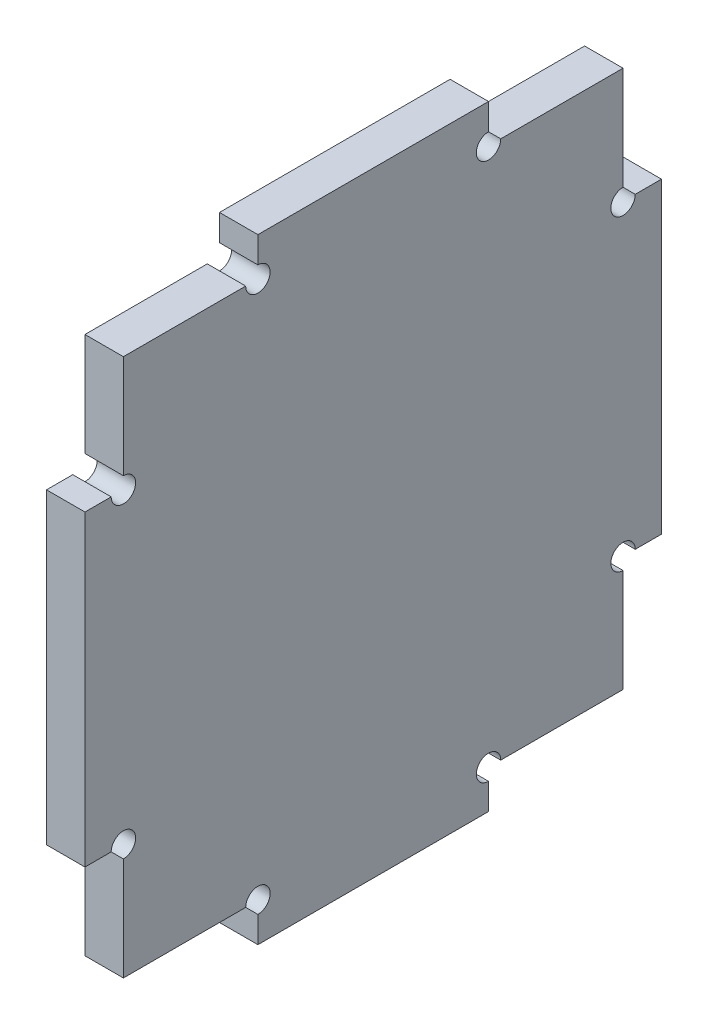
ISO-10303-21;
HEADER;
FILE_DESCRIPTION(('STEP AP214'),'2;1');
FILE_NAME('part.step','',(''),(''),'','','');
FILE_SCHEMA(('AUTOMOTIVE_DESIGN { 1 0 10303 214 1 1 1 1 }'));
ENDSEC;
DATA;
#1=APPLICATION_CONTEXT('core data for automotive mechanical design processes');
#2=APPLICATION_PROTOCOL_DEFINITION('international standard','automotive_design',2000,#1);
#3=PRODUCT_CONTEXT('',#1,'mechanical');
#4=PRODUCT('Part','Part','',(#3));
#5=PRODUCT_RELATED_PRODUCT_CATEGORY('part','',(#4));
#6=PRODUCT_DEFINITION_FORMATION('','',#4);
#7=PRODUCT_DEFINITION_CONTEXT('part definition',#1,'design');
#8=PRODUCT_DEFINITION('design','',#6,#7);
#9=PRODUCT_DEFINITION_SHAPE('','',#8);
#10=(LENGTH_UNIT() NAMED_UNIT(*) SI_UNIT(.MILLI.,.METRE.));
#11=(NAMED_UNIT(*) PLANE_ANGLE_UNIT() SI_UNIT($,.RADIAN.));
#12=(NAMED_UNIT(*) SI_UNIT($,.STERADIAN.) SOLID_ANGLE_UNIT());
#13=UNCERTAINTY_MEASURE_WITH_UNIT(LENGTH_MEASURE(1.E-05),#10,'distance_accuracy_value','');
#14=(GEOMETRIC_REPRESENTATION_CONTEXT(3) GLOBAL_UNCERTAINTY_ASSIGNED_CONTEXT((#13)) GLOBAL_UNIT_ASSIGNED_CONTEXT((#10,
#11,#12)) REPRESENTATION_CONTEXT('',''));
#15=CARTESIAN_POINT('',(0.,0.,0.));
#16=DIRECTION('',(0.,0.,1.));
#17=DIRECTION('',(1.,0.,0.));
#18=AXIS2_PLACEMENT_3D('',#15,#16,#17);
#19=CARTESIAN_POINT('',(5.,0.,0.));
#20=DIRECTION('',(-1.,0.,0.));
#21=DIRECTION('',(0.,0.,1.));
#22=AXIS2_PLACEMENT_3D('',#19,#20,#21);
#23=PLANE('',#22);
#24=DIRECTION('',(0.,-1.,0.));
#25=VECTOR('',#24,1.);
#26=CARTESIAN_POINT('',(5.,0.,32.5));
#27=LINE('',#26,#25);
#28=CARTESIAN_POINT('',(5.,35.,32.5));
#29=VERTEX_POINT('',#28);
#30=CARTESIAN_POINT('',(5.,21.5875,32.5));
#31=VERTEX_POINT('',#30);
#32=EDGE_CURVE('E366',#29,#31,#27,.T.);
#33=ORIENTED_EDGE('',*,*,#32,.T.);
#34=CARTESIAN_POINT('',(5.,20.,32.5));
#35=DIRECTION('',(1.,0.,0.));
#36=DIRECTION('',(0.,0.,-1.));
#37=AXIS2_PLACEMENT_3D('',#34,#35,#36);
#38=CIRCLE('',#37,1.5875);
#39=CARTESIAN_POINT('',(5.,20.,34.0875));
#40=VERTEX_POINT('',#39);
#41=EDGE_CURVE('E440',#40,#31,#38,.T.);
#42=ORIENTED_EDGE('',*,*,#41,.F.);
#43=DIRECTION('',(0.,0.,1.));
#44=VECTOR('',#43,1.);
#45=CARTESIAN_POINT('',(5.,20.,0.));
#46=LINE('',#45,#44);
#47=CARTESIAN_POINT('',(5.,20.,37.5));
#48=VERTEX_POINT('',#47);
#49=EDGE_CURVE('E356',#40,#48,#46,.T.);
#50=ORIENTED_EDGE('',*,*,#49,.T.);
#51=DIRECTION('',(0.,-1.,0.));
#52=VECTOR('',#51,1.);
#53=CARTESIAN_POINT('',(5.,-40.,37.5));
#54=LINE('',#53,#52);
#55=CARTESIAN_POINT('',(5.,-20.,37.5));
#56=VERTEX_POINT('',#55);
#57=EDGE_CURVE('E385',#48,#56,#54,.T.);
#58=ORIENTED_EDGE('',*,*,#57,.T.);
#59=DIRECTION('',(0.,0.,1.));
#60=VECTOR('',#59,1.);
#61=CARTESIAN_POINT('',(5.,-20.,0.));
#62=LINE('',#61,#60);
#63=CARTESIAN_POINT('',(5.,-20.,34.0875));
#64=VERTEX_POINT('',#63);
#65=EDGE_CURVE('E334',#64,#56,#62,.T.);
#66=ORIENTED_EDGE('',*,*,#65,.F.);
#67=CARTESIAN_POINT('',(5.,-20.,32.5));
#68=DIRECTION('',(1.,0.,0.));
#69=DIRECTION('',(0.,0.,-1.));
#70=AXIS2_PLACEMENT_3D('',#67,#68,#69);
#71=CIRCLE('',#70,1.5875);
#72=CARTESIAN_POINT('',(5.,-21.5875,32.5));
#73=VERTEX_POINT('',#72);
#74=EDGE_CURVE('E446',#73,#64,#71,.T.);
#75=ORIENTED_EDGE('',*,*,#74,.F.);
#76=DIRECTION('',(0.,1.,0.));
#77=VECTOR('',#76,1.);
#78=CARTESIAN_POINT('',(5.,0.,32.5));
#79=LINE('',#78,#77);
#80=CARTESIAN_POINT('',(5.,-35.,32.5));
#81=VERTEX_POINT('',#80);
#82=EDGE_CURVE('E330',#81,#73,#79,.T.);
#83=ORIENTED_EDGE('',*,*,#82,.F.);
#84=DIRECTION('',(0.,0.,1.));
#85=VECTOR('',#84,1.);
#86=CARTESIAN_POINT('',(5.,-35.,0.));
#87=LINE('',#86,#85);
#88=CARTESIAN_POINT('',(5.,-35.,16.5875));
#89=VERTEX_POINT('',#88);
#90=EDGE_CURVE('E327',#89,#81,#87,.T.);
#91=ORIENTED_EDGE('',*,*,#90,.F.);
#92=CARTESIAN_POINT('',(5.,-35.,15.));
#93=DIRECTION('',(1.,0.,0.));
#94=DIRECTION('',(0.,0.,-1.));
#95=AXIS2_PLACEMENT_3D('',#92,#93,#94);
#96=CIRCLE('',#95,1.5875);
#97=CARTESIAN_POINT('',(5.,-36.5875,15.));
#98=VERTEX_POINT('',#97);
#99=EDGE_CURVE('E545',#98,#89,#96,.T.);
#100=ORIENTED_EDGE('',*,*,#99,.F.);
#101=DIRECTION('',(0.,1.,0.));
#102=VECTOR('',#101,1.);
#103=CARTESIAN_POINT('',(5.,0.,15.));
#104=LINE('',#103,#102);
#105=CARTESIAN_POINT('',(5.,-40.,15.));
#106=VERTEX_POINT('',#105);
#107=EDGE_CURVE('E317',#106,#98,#104,.T.);
#108=ORIENTED_EDGE('',*,*,#107,.F.);
#109=DIRECTION('',(0.,0.,-1.));
#110=VECTOR('',#109,1.);
#111=CARTESIAN_POINT('',(5.,-40.,37.5));
#112=LINE('',#111,#110);
#113=CARTESIAN_POINT('',(5.,-40.,-15.));
#114=VERTEX_POINT('',#113);
#115=EDGE_CURVE('E389',#106,#114,#112,.T.);
#116=ORIENTED_EDGE('',*,*,#115,.T.);
#117=DIRECTION('',(0.,1.,0.));
#118=VECTOR('',#117,1.);
#119=CARTESIAN_POINT('',(5.,0.,-15.));
#120=LINE('',#119,#118);
#121=CARTESIAN_POINT('',(5.,-36.5875,-15.));
#122=VERTEX_POINT('',#121);
#123=EDGE_CURVE('E243',#114,#122,#120,.T.);
#124=ORIENTED_EDGE('',*,*,#123,.T.);
#125=CARTESIAN_POINT('',(5.,-35.,-15.));
#126=DIRECTION('',(1.,0.,0.));
#127=DIRECTION('',(0.,0.,-1.));
#128=AXIS2_PLACEMENT_3D('',#125,#126,#127);
#129=CIRCLE('',#128,1.5875);
#130=CARTESIAN_POINT('',(5.,-35.,-16.5875));
#131=VERTEX_POINT('',#130);
#132=EDGE_CURVE('E225',#131,#122,#129,.T.);
#133=ORIENTED_EDGE('',*,*,#132,.F.);
#134=DIRECTION('',(0.,0.,-1.));
#135=VECTOR('',#134,1.);
#136=CARTESIAN_POINT('',(5.,-35.,0.));
#137=LINE('',#136,#135);
#138=CARTESIAN_POINT('',(5.,-35.,-32.5));
#139=VERTEX_POINT('',#138);
#140=EDGE_CURVE('E240',#131,#139,#137,.T.);
#141=ORIENTED_EDGE('',*,*,#140,.T.);
#142=DIRECTION('',(0.,1.,0.));
#143=VECTOR('',#142,1.);
#144=CARTESIAN_POINT('',(5.,0.,-32.5));
#145=LINE('',#144,#143);
#146=CARTESIAN_POINT('',(5.,-21.5875,-32.5));
#147=VERTEX_POINT('',#146);
#148=EDGE_CURVE('E253',#139,#147,#145,.T.);
#149=ORIENTED_EDGE('',*,*,#148,.T.);
#150=CARTESIAN_POINT('',(5.,-20.,-32.5));
#151=DIRECTION('',(1.,0.,0.));
#152=DIRECTION('',(0.,0.,-1.));
#153=AXIS2_PLACEMENT_3D('',#150,#151,#152);
#154=CIRCLE('',#153,1.5875);
#155=CARTESIAN_POINT('',(5.,-20.,-34.0875));
#156=VERTEX_POINT('',#155);
#157=EDGE_CURVE('E507',#156,#147,#154,.T.);
#158=ORIENTED_EDGE('',*,*,#157,.F.);
#159=DIRECTION('',(0.,0.,-1.));
#160=VECTOR('',#159,1.);
#161=CARTESIAN_POINT('',(5.,-20.,0.));
#162=LINE('',#161,#160);
#163=CARTESIAN_POINT('',(5.,-20.,-37.5));
#164=VERTEX_POINT('',#163);
#165=EDGE_CURVE('E259',#156,#164,#162,.T.);
#166=ORIENTED_EDGE('',*,*,#165,.T.);
#167=DIRECTION('',(0.,1.,0.));
#168=VECTOR('',#167,1.);
#169=CARTESIAN_POINT('',(5.,-40.,-37.5));
#170=LINE('',#169,#168);
#171=CARTESIAN_POINT('',(5.,20.,-37.5));
#172=VERTEX_POINT('',#171);
#173=EDGE_CURVE('E377',#164,#172,#170,.T.);
#174=ORIENTED_EDGE('',*,*,#173,.T.);
#175=DIRECTION('',(0.,0.,-1.));
#176=VECTOR('',#175,1.);
#177=CARTESIAN_POINT('',(5.,20.,0.));
#178=LINE('',#177,#176);
#179=CARTESIAN_POINT('',(5.,20.,-34.0875));
#180=VERTEX_POINT('',#179);
#181=EDGE_CURVE('E288',#180,#172,#178,.T.);
#182=ORIENTED_EDGE('',*,*,#181,.F.);
#183=CARTESIAN_POINT('',(5.,20.,-32.5));
#184=DIRECTION('',(1.,0.,0.));
#185=DIRECTION('',(0.,0.,-1.));
#186=AXIS2_PLACEMENT_3D('',#183,#184,#185);
#187=CIRCLE('',#186,1.5875);
#188=CARTESIAN_POINT('',(5.,21.5875,-32.5));
#189=VERTEX_POINT('',#188);
#190=EDGE_CURVE('E526',#189,#180,#187,.T.);
#191=ORIENTED_EDGE('',*,*,#190,.F.);
#192=DIRECTION('',(0.,-1.,0.));
#193=VECTOR('',#192,1.);
#194=CARTESIAN_POINT('',(5.,0.,-32.5));
#195=LINE('',#194,#193);
#196=CARTESIAN_POINT('',(5.,35.,-32.5));
#197=VERTEX_POINT('',#196);
#198=EDGE_CURVE('E294',#197,#189,#195,.T.);
#199=ORIENTED_EDGE('',*,*,#198,.F.);
#200=DIRECTION('',(0.,0.,-1.));
#201=VECTOR('',#200,1.);
#202=CARTESIAN_POINT('',(5.,35.,0.));
#203=LINE('',#202,#201);
#204=CARTESIAN_POINT('',(5.,35.,-16.5875));
#205=VERTEX_POINT('',#204);
#206=EDGE_CURVE('E291',#205,#197,#203,.T.);
#207=ORIENTED_EDGE('',*,*,#206,.F.);
#208=CARTESIAN_POINT('',(5.,35.,-15.));
#209=DIRECTION('',(1.,0.,0.));
#210=DIRECTION('',(0.,0.,-1.));
#211=AXIS2_PLACEMENT_3D('',#208,#209,#210);
#212=CIRCLE('',#211,1.5875);
#213=CARTESIAN_POINT('',(5.,36.5875,-15.));
#214=VERTEX_POINT('',#213);
#215=EDGE_CURVE('E525',#214,#205,#212,.T.);
#216=ORIENTED_EDGE('',*,*,#215,.F.);
#217=DIRECTION('',(0.,-1.,0.));
#218=VECTOR('',#217,1.);
#219=CARTESIAN_POINT('',(5.,0.,-15.));
#220=LINE('',#219,#218);
#221=CARTESIAN_POINT('',(5.,40.,-15.));
#222=VERTEX_POINT('',#221);
#223=EDGE_CURVE('E278',#222,#214,#220,.T.);
#224=ORIENTED_EDGE('',*,*,#223,.F.);
#225=DIRECTION('',(0.,0.,1.));
#226=VECTOR('',#225,1.);
#227=CARTESIAN_POINT('',(5.,40.,37.5));
#228=LINE('',#227,#226);
#229=CARTESIAN_POINT('',(5.,40.,15.));
#230=VERTEX_POINT('',#229);
#231=EDGE_CURVE('E381',#222,#230,#228,.T.);
#232=ORIENTED_EDGE('',*,*,#231,.T.);
#233=DIRECTION('',(0.,-1.,0.));
#234=VECTOR('',#233,1.);
#235=CARTESIAN_POINT('',(5.,0.,15.));
#236=LINE('',#235,#234);
#237=CARTESIAN_POINT('',(5.,36.5875,15.));
#238=VERTEX_POINT('',#237);
#239=EDGE_CURVE('E372',#230,#238,#236,.T.);
#240=ORIENTED_EDGE('',*,*,#239,.T.);
#241=CARTESIAN_POINT('',(5.,35.,15.));
#242=DIRECTION('',(1.,0.,0.));
#243=DIRECTION('',(0.,0.,-1.));
#244=AXIS2_PLACEMENT_3D('',#241,#242,#243);
#245=CIRCLE('',#244,1.5875);
#246=CARTESIAN_POINT('',(5.,35.,16.5875));
#247=VERTEX_POINT('',#246);
#248=EDGE_CURVE('E452',#247,#238,#245,.T.);
#249=ORIENTED_EDGE('',*,*,#248,.F.);
#250=DIRECTION('',(0.,0.,1.));
#251=VECTOR('',#250,1.);
#252=CARTESIAN_POINT('',(5.,35.,0.));
#253=LINE('',#252,#251);
#254=EDGE_CURVE('E369',#247,#29,#253,.T.);
#255=ORIENTED_EDGE('',*,*,#254,.T.);
#256=EDGE_LOOP('',(#33,#42,#50,#58,#66,#75,#83,#91,#100,#108,#116,#124,#133,#141,#149,#158,#166,
#174,#182,#191,#199,#207,#216,#224,#232,#240,#249,#255));
#257=FACE_BOUND('',#256,.T.);
#258=ADVANCED_FACE('F38',(#257),#23,.F.);
#259=CARTESIAN_POINT('',(0.,0.,0.));
#260=DIRECTION('',(-1.,0.,0.));
#261=DIRECTION('',(0.,0.,1.));
#262=AXIS2_PLACEMENT_3D('',#259,#260,#261);
#263=PLANE('',#262);
#264=CARTESIAN_POINT('',(0.,20.,32.5));
#265=DIRECTION('',(1.,0.,0.));
#266=DIRECTION('',(0.,0.,-1.));
#267=AXIS2_PLACEMENT_3D('',#264,#265,#266);
#268=CIRCLE('',#267,1.5875);
#269=CARTESIAN_POINT('',(0.,20.,34.0875));
#270=VERTEX_POINT('',#269);
#271=CARTESIAN_POINT('',(0.,21.5875,32.5));
#272=VERTEX_POINT('',#271);
#273=EDGE_CURVE('E61',#270,#272,#268,.T.);
#274=ORIENTED_EDGE('',*,*,#273,.T.);
#275=DIRECTION('',(0.,1.,0.));
#276=VECTOR('',#275,1.);
#277=CARTESIAN_POINT('',(0.,20.,32.5));
#278=LINE('',#277,#276);
#279=CARTESIAN_POINT('',(0.,35.,32.5));
#280=VERTEX_POINT('',#279);
#281=EDGE_CURVE('E341',#272,#280,#278,.T.);
#282=ORIENTED_EDGE('',*,*,#281,.T.);
#283=DIRECTION('',(0.,0.,-1.));
#284=VECTOR('',#283,1.);
#285=CARTESIAN_POINT('',(0.,35.,32.5));
#286=LINE('',#285,#284);
#287=CARTESIAN_POINT('',(0.,35.,16.5875));
#288=VERTEX_POINT('',#287);
#289=EDGE_CURVE('E344',#280,#288,#286,.T.);
#290=ORIENTED_EDGE('',*,*,#289,.T.);
#291=CARTESIAN_POINT('',(0.,35.,15.));
#292=DIRECTION('',(1.,0.,0.));
#293=DIRECTION('',(0.,0.,-1.));
#294=AXIS2_PLACEMENT_3D('',#291,#292,#293);
#295=CIRCLE('',#294,1.5875);
#296=CARTESIAN_POINT('',(0.,36.5875,15.));
#297=VERTEX_POINT('',#296);
#298=EDGE_CURVE('E54',#288,#297,#295,.T.);
#299=ORIENTED_EDGE('',*,*,#298,.T.);
#300=DIRECTION('',(0.,1.,0.));
#301=VECTOR('',#300,1.);
#302=CARTESIAN_POINT('',(0.,35.,15.));
#303=LINE('',#302,#301);
#304=CARTESIAN_POINT('',(0.,40.,15.));
#305=VERTEX_POINT('',#304);
#306=EDGE_CURVE('E348',#297,#305,#303,.T.);
#307=ORIENTED_EDGE('',*,*,#306,.T.);
#308=DIRECTION('',(0.,0.,1.));
#309=VECTOR('',#308,1.);
#310=CARTESIAN_POINT('',(0.,40.,37.5));
#311=LINE('',#310,#309);
#312=CARTESIAN_POINT('',(0.,40.,-15.));
#313=VERTEX_POINT('',#312);
#314=EDGE_CURVE('E395',#313,#305,#311,.T.);
#315=ORIENTED_EDGE('',*,*,#314,.F.);
#316=DIRECTION('',(0.,1.,0.));
#317=VECTOR('',#316,1.);
#318=CARTESIAN_POINT('',(0.,35.,-15.));
#319=LINE('',#318,#317);
#320=CARTESIAN_POINT('',(0.,36.5875,-15.));
#321=VERTEX_POINT('',#320);
#322=EDGE_CURVE('E252',#321,#313,#319,.T.);
#323=ORIENTED_EDGE('',*,*,#322,.F.);
#324=CARTESIAN_POINT('',(0.,35.,-15.));
#325=DIRECTION('',(1.,0.,0.));
#326=DIRECTION('',(0.,0.,-1.));
#327=AXIS2_PLACEMENT_3D('',#324,#325,#326);
#328=CIRCLE('',#327,1.5875);
#329=CARTESIAN_POINT('',(0.,35.,-16.5875));
#330=VERTEX_POINT('',#329);
#331=EDGE_CURVE('E454',#321,#330,#328,.T.);
#332=ORIENTED_EDGE('',*,*,#331,.T.);
#333=DIRECTION('',(0.,0.,1.));
#334=VECTOR('',#333,1.);
#335=CARTESIAN_POINT('',(0.,35.,-32.5));
#336=LINE('',#335,#334);
#337=CARTESIAN_POINT('',(0.,35.,-32.5));
#338=VERTEX_POINT('',#337);
#339=EDGE_CURVE('E257',#338,#330,#336,.T.);
#340=ORIENTED_EDGE('',*,*,#339,.F.);
#341=DIRECTION('',(0.,1.,0.));
#342=VECTOR('',#341,1.);
#343=CARTESIAN_POINT('',(0.,20.,-32.5));
#344=LINE('',#343,#342);
#345=CARTESIAN_POINT('',(0.,21.5875,-32.5));
#346=VERTEX_POINT('',#345);
#347=EDGE_CURVE('E266',#346,#338,#344,.T.);
#348=ORIENTED_EDGE('',*,*,#347,.F.);
#349=CARTESIAN_POINT('',(0.,20.,-32.5));
#350=DIRECTION('',(1.,0.,0.));
#351=DIRECTION('',(0.,0.,-1.));
#352=AXIS2_PLACEMENT_3D('',#349,#350,#351);
#353=CIRCLE('',#352,1.5875);
#354=CARTESIAN_POINT('',(0.,20.,-34.0875));
#355=VERTEX_POINT('',#354);
#356=EDGE_CURVE('E520',#346,#355,#353,.T.);
#357=ORIENTED_EDGE('',*,*,#356,.T.);
#358=DIRECTION('',(0.,0.,1.));
#359=VECTOR('',#358,1.);
#360=CARTESIAN_POINT('',(0.,20.,-37.5));
#361=LINE('',#360,#359);
#362=CARTESIAN_POINT('',(0.,20.,-37.5));
#363=VERTEX_POINT('',#362);
#364=EDGE_CURVE('E269',#363,#355,#361,.T.);
#365=ORIENTED_EDGE('',*,*,#364,.F.);
#366=DIRECTION('',(0.,1.,0.));
#367=VECTOR('',#366,1.);
#368=CARTESIAN_POINT('',(0.,-40.,-37.5));
#369=LINE('',#368,#367);
#370=CARTESIAN_POINT('',(0.,-20.,-37.5));
#371=VERTEX_POINT('',#370);
#372=EDGE_CURVE('E376',#371,#363,#369,.T.);
#373=ORIENTED_EDGE('',*,*,#372,.F.);
#374=DIRECTION('',(0.,0.,1.));
#375=VECTOR('',#374,1.);
#376=CARTESIAN_POINT('',(0.,-20.,-37.5));
#377=LINE('',#376,#375);
#378=CARTESIAN_POINT('',(0.,-20.,-34.0875));
#379=VERTEX_POINT('',#378);
#380=EDGE_CURVE('E478',#371,#379,#377,.T.);
#381=ORIENTED_EDGE('',*,*,#380,.T.);
#382=CARTESIAN_POINT('',(0.,-20.,-32.5));
#383=DIRECTION('',(1.,0.,0.));
#384=DIRECTION('',(0.,0.,-1.));
#385=AXIS2_PLACEMENT_3D('',#382,#383,#384);
#386=CIRCLE('',#385,1.5875);
#387=CARTESIAN_POINT('',(0.,-21.5875,-32.5));
#388=VERTEX_POINT('',#387);
#389=EDGE_CURVE('E531',#379,#388,#386,.T.);
#390=ORIENTED_EDGE('',*,*,#389,.T.);
#391=DIRECTION('',(0.,-1.,0.));
#392=VECTOR('',#391,1.);
#393=CARTESIAN_POINT('',(0.,-20.,-32.5));
#394=LINE('',#393,#392);
#395=CARTESIAN_POINT('',(0.,-35.,-32.5));
#396=VERTEX_POINT('',#395);
#397=EDGE_CURVE('E482',#388,#396,#394,.T.);
#398=ORIENTED_EDGE('',*,*,#397,.T.);
#399=DIRECTION('',(0.,0.,1.));
#400=VECTOR('',#399,1.);
#401=CARTESIAN_POINT('',(0.,-35.,-32.5));
#402=LINE('',#401,#400);
#403=CARTESIAN_POINT('',(0.,-35.,-16.5875));
#404=VERTEX_POINT('',#403);
#405=EDGE_CURVE('E485',#396,#404,#402,.T.);
#406=ORIENTED_EDGE('',*,*,#405,.T.);
#407=CARTESIAN_POINT('',(0.,-35.,-15.));
#408=DIRECTION('',(1.,0.,0.));
#409=DIRECTION('',(0.,0.,-1.));
#410=AXIS2_PLACEMENT_3D('',#407,#408,#409);
#411=CIRCLE('',#410,1.5875);
#412=CARTESIAN_POINT('',(0.,-36.5875,-15.));
#413=VERTEX_POINT('',#412);
#414=EDGE_CURVE('E228',#404,#413,#411,.T.);
#415=ORIENTED_EDGE('',*,*,#414,.T.);
#416=DIRECTION('',(0.,-1.,0.));
#417=VECTOR('',#416,1.);
#418=CARTESIAN_POINT('',(0.,-35.,-15.));
#419=LINE('',#418,#417);
#420=CARTESIAN_POINT('',(0.,-40.,-15.));
#421=VERTEX_POINT('',#420);
#422=EDGE_CURVE('E488',#413,#421,#419,.T.);
#423=ORIENTED_EDGE('',*,*,#422,.T.);
#424=DIRECTION('',(0.,0.,-1.));
#425=VECTOR('',#424,1.);
#426=CARTESIAN_POINT('',(0.,-40.,37.5));
#427=LINE('',#426,#425);
#428=CARTESIAN_POINT('',(0.,-40.,15.));
#429=VERTEX_POINT('',#428);
#430=EDGE_CURVE('E382',#429,#421,#427,.T.);
#431=ORIENTED_EDGE('',*,*,#430,.F.);
#432=DIRECTION('',(0.,-1.,0.));
#433=VECTOR('',#432,1.);
#434=CARTESIAN_POINT('',(0.,-35.,15.));
#435=LINE('',#434,#433);
#436=CARTESIAN_POINT('',(0.,-36.5875,15.));
#437=VERTEX_POINT('',#436);
#438=EDGE_CURVE('E298',#437,#429,#435,.T.);
#439=ORIENTED_EDGE('',*,*,#438,.F.);
#440=CARTESIAN_POINT('',(0.,-35.,15.));
#441=DIRECTION('',(1.,0.,0.));
#442=DIRECTION('',(0.,0.,-1.));
#443=AXIS2_PLACEMENT_3D('',#440,#441,#442);
#444=CIRCLE('',#443,1.5875);
#445=CARTESIAN_POINT('',(0.,-35.,16.5875));
#446=VERTEX_POINT('',#445);
#447=EDGE_CURVE('E245',#437,#446,#444,.T.);
#448=ORIENTED_EDGE('',*,*,#447,.T.);
#449=DIRECTION('',(0.,0.,-1.));
#450=VECTOR('',#449,1.);
#451=CARTESIAN_POINT('',(0.,-35.,32.5));
#452=LINE('',#451,#450);
#453=CARTESIAN_POINT('',(0.,-35.,32.5));
#454=VERTEX_POINT('',#453);
#455=EDGE_CURVE('E301',#454,#446,#452,.T.);
#456=ORIENTED_EDGE('',*,*,#455,.F.);
#457=DIRECTION('',(0.,-1.,0.));
#458=VECTOR('',#457,1.);
#459=CARTESIAN_POINT('',(0.,-20.,32.5));
#460=LINE('',#459,#458);
#461=CARTESIAN_POINT('',(0.,-21.5875,32.5));
#462=VERTEX_POINT('',#461);
#463=EDGE_CURVE('E305',#462,#454,#460,.T.);
#464=ORIENTED_EDGE('',*,*,#463,.F.);
#465=CARTESIAN_POINT('',(0.,-20.,32.5));
#466=DIRECTION('',(1.,0.,0.));
#467=DIRECTION('',(0.,0.,-1.));
#468=AXIS2_PLACEMENT_3D('',#465,#466,#467);
#469=CIRCLE('',#468,1.5875);
#470=CARTESIAN_POINT('',(0.,-20.,34.0875));
#471=VERTEX_POINT('',#470);
#472=EDGE_CURVE('E548',#462,#471,#469,.T.);
#473=ORIENTED_EDGE('',*,*,#472,.T.);
#474=DIRECTION('',(0.,0.,-1.));
#475=VECTOR('',#474,1.);
#476=CARTESIAN_POINT('',(0.,-20.,37.5));
#477=LINE('',#476,#475);
#478=CARTESIAN_POINT('',(0.,-20.,37.5));
#479=VERTEX_POINT('',#478);
#480=EDGE_CURVE('E308',#479,#471,#477,.T.);
#481=ORIENTED_EDGE('',*,*,#480,.F.);
#482=DIRECTION('',(0.,-1.,0.));
#483=VECTOR('',#482,1.);
#484=CARTESIAN_POINT('',(0.,-40.,37.5));
#485=LINE('',#484,#483);
#486=CARTESIAN_POINT('',(0.,20.,37.5));
#487=VERTEX_POINT('',#486);
#488=EDGE_CURVE('E399',#487,#479,#485,.T.);
#489=ORIENTED_EDGE('',*,*,#488,.F.);
#490=DIRECTION('',(0.,0.,-1.));
#491=VECTOR('',#490,1.);
#492=CARTESIAN_POINT('',(0.,20.,37.5));
#493=LINE('',#492,#491);
#494=EDGE_CURVE('E337',#487,#270,#493,.T.);
#495=ORIENTED_EDGE('',*,*,#494,.T.);
#496=EDGE_LOOP('',(#274,#282,#290,#299,#307,#315,#323,#332,#340,#348,#357,#365,#373,#381,#390,
#398,#406,#415,#423,#431,#439,#448,#456,#464,#473,#481,#489,#495));
#497=FACE_BOUND('',#496,.T.);
#498=ADVANCED_FACE('F431',(#497),#263,.T.);
#499=CARTESIAN_POINT('',(5.,-40.,-37.5));
#500=DIRECTION('',(0.,0.,1.));
#501=DIRECTION('',(1.,0.,0.));
#502=AXIS2_PLACEMENT_3D('',#499,#500,#501);
#503=PLANE('',#502);
#504=ORIENTED_EDGE('',*,*,#173,.F.);
#505=DIRECTION('',(1.,0.,0.));
#506=VECTOR('',#505,1.);
#507=CARTESIAN_POINT('',(0.,-20.,-37.5));
#508=LINE('',#507,#506);
#509=EDGE_CURVE('E491',#371,#164,#508,.T.);
#510=ORIENTED_EDGE('',*,*,#509,.F.);
#511=ORIENTED_EDGE('',*,*,#372,.T.);
#512=DIRECTION('',(1.,0.,0.));
#513=VECTOR('',#512,1.);
#514=CARTESIAN_POINT('',(0.,20.,-37.5));
#515=LINE('',#514,#513);
#516=EDGE_CURVE('E274',#363,#172,#515,.T.);
#517=ORIENTED_EDGE('',*,*,#516,.T.);
#518=EDGE_LOOP('',(#504,#510,#511,#517));
#519=FACE_BOUND('',#518,.T.);
#520=ADVANCED_FACE('F40',(#519),#503,.F.);
#521=CARTESIAN_POINT('',(5.,40.,37.5));
#522=DIRECTION('',(0.,-1.,0.));
#523=DIRECTION('',(0.,0.,-1.));
#524=AXIS2_PLACEMENT_3D('',#521,#522,#523);
#525=PLANE('',#524);
#526=DIRECTION('',(1.,0.,0.));
#527=VECTOR('',#526,1.);
#528=CARTESIAN_POINT('',(0.,40.,-15.));
#529=LINE('',#528,#527);
#530=EDGE_CURVE('E273',#313,#222,#529,.T.);
#531=ORIENTED_EDGE('',*,*,#530,.F.);
#532=ORIENTED_EDGE('',*,*,#314,.T.);
#533=DIRECTION('',(1.,0.,0.));
#534=VECTOR('',#533,1.);
#535=CARTESIAN_POINT('',(0.,40.,15.));
#536=LINE('',#535,#534);
#537=EDGE_CURVE('E352',#305,#230,#536,.T.);
#538=ORIENTED_EDGE('',*,*,#537,.T.);
#539=ORIENTED_EDGE('',*,*,#231,.F.);
#540=EDGE_LOOP('',(#531,#532,#538,#539));
#541=FACE_BOUND('',#540,.T.);
#542=ADVANCED_FACE('F586',(#541),#525,.F.);
#543=CARTESIAN_POINT('',(5.,-40.,37.5));
#544=DIRECTION('',(0.,0.,-1.));
#545=DIRECTION('',(-1.,0.,0.));
#546=AXIS2_PLACEMENT_3D('',#543,#544,#545);
#547=PLANE('',#546);
#548=DIRECTION('',(1.,0.,0.));
#549=VECTOR('',#548,1.);
#550=CARTESIAN_POINT('',(0.,-20.,37.5));
#551=LINE('',#550,#549);
#552=EDGE_CURVE('E313',#479,#56,#551,.T.);
#553=ORIENTED_EDGE('',*,*,#552,.T.);
#554=ORIENTED_EDGE('',*,*,#57,.F.);
#555=DIRECTION('',(1.,0.,0.));
#556=VECTOR('',#555,1.);
#557=CARTESIAN_POINT('',(0.,20.,37.5));
#558=LINE('',#557,#556);
#559=EDGE_CURVE('E351',#487,#48,#558,.T.);
#560=ORIENTED_EDGE('',*,*,#559,.F.);
#561=ORIENTED_EDGE('',*,*,#488,.T.);
#562=EDGE_LOOP('',(#553,#554,#560,#561));
#563=FACE_BOUND('',#562,.T.);
#564=ADVANCED_FACE('F436',(#563),#547,.F.);
#565=CARTESIAN_POINT('',(5.,-40.,37.5));
#566=DIRECTION('',(0.,1.,0.));
#567=DIRECTION('',(0.,0.,1.));
#568=AXIS2_PLACEMENT_3D('',#565,#566,#567);
#569=PLANE('',#568);
#570=ORIENTED_EDGE('',*,*,#430,.T.);
#571=DIRECTION('',(1.,0.,0.));
#572=VECTOR('',#571,1.);
#573=CARTESIAN_POINT('',(0.,-40.,-15.));
#574=LINE('',#573,#572);
#575=EDGE_CURVE('E492',#421,#114,#574,.T.);
#576=ORIENTED_EDGE('',*,*,#575,.T.);
#577=ORIENTED_EDGE('',*,*,#115,.F.);
#578=DIRECTION('',(1.,0.,0.));
#579=VECTOR('',#578,1.);
#580=CARTESIAN_POINT('',(0.,-40.,15.));
#581=LINE('',#580,#579);
#582=EDGE_CURVE('E312',#429,#106,#581,.T.);
#583=ORIENTED_EDGE('',*,*,#582,.F.);
#584=EDGE_LOOP('',(#570,#576,#577,#583));
#585=FACE_BOUND('',#584,.T.);
#586=ADVANCED_FACE('F580',(#585),#569,.F.);
#587=CARTESIAN_POINT('',(0.,35.,15.));
#588=DIRECTION('',(0.,0.,-1.));
#589=DIRECTION('',(0.,1.,0.));
#590=AXIS2_PLACEMENT_3D('',#587,#588,#589);
#591=PLANE('',#590);
#592=ORIENTED_EDGE('',*,*,#306,.F.);
#593=DIRECTION('',(1.,0.,0.));
#594=VECTOR('',#593,1.);
#595=CARTESIAN_POINT('',(0.,36.5875,15.));
#596=LINE('',#595,#594);
#597=EDGE_CURVE('E474',#297,#238,#596,.T.);
#598=ORIENTED_EDGE('',*,*,#597,.T.);
#599=ORIENTED_EDGE('',*,*,#239,.F.);
#600=ORIENTED_EDGE('',*,*,#537,.F.);
#601=EDGE_LOOP('',(#592,#598,#599,#600));
#602=FACE_BOUND('',#601,.T.);
#603=ADVANCED_FACE('F583',(#602),#591,.F.);
#604=CARTESIAN_POINT('',(0.,35.,32.5));
#605=DIRECTION('',(0.,-1.,0.));
#606=DIRECTION('',(0.,0.,-1.));
#607=AXIS2_PLACEMENT_3D('',#604,#605,#606);
#608=PLANE('',#607);
#609=ORIENTED_EDGE('',*,*,#254,.F.);
#610=DIRECTION('',(1.,0.,0.));
#611=VECTOR('',#610,1.);
#612=CARTESIAN_POINT('',(0.,35.,16.5875));
#613=LINE('',#612,#611);
#614=EDGE_CURVE('E11',#247,#288,#613,.F.);
#615=ORIENTED_EDGE('',*,*,#614,.T.);
#616=ORIENTED_EDGE('',*,*,#289,.F.);
#617=DIRECTION('',(1.,0.,0.));
#618=VECTOR('',#617,1.);
#619=CARTESIAN_POINT('',(0.,35.,32.5));
#620=LINE('',#619,#618);
#621=EDGE_CURVE('E357',#280,#29,#620,.T.);
#622=ORIENTED_EDGE('',*,*,#621,.T.);
#623=EDGE_LOOP('',(#609,#615,#616,#622));
#624=FACE_BOUND('',#623,.T.);
#625=ADVANCED_FACE('F820',(#624),#608,.F.);
#626=CARTESIAN_POINT('',(0.,20.,32.5));
#627=DIRECTION('',(0.,0.,-1.));
#628=DIRECTION('',(-1.,0.,0.));
#629=AXIS2_PLACEMENT_3D('',#626,#627,#628);
#630=PLANE('',#629);
#631=ORIENTED_EDGE('',*,*,#281,.F.);
#632=DIRECTION('',(1.,0.,0.));
#633=VECTOR('',#632,1.);
#634=CARTESIAN_POINT('',(0.,21.5875,32.5));
#635=LINE('',#634,#633);
#636=EDGE_CURVE('E471',#272,#31,#635,.T.);
#637=ORIENTED_EDGE('',*,*,#636,.T.);
#638=ORIENTED_EDGE('',*,*,#32,.F.);
#639=ORIENTED_EDGE('',*,*,#621,.F.);
#640=EDGE_LOOP('',(#631,#637,#638,#639));
#641=FACE_BOUND('',#640,.T.);
#642=ADVANCED_FACE('F568',(#641),#630,.F.);
#643=CARTESIAN_POINT('',(0.,20.,37.5));
#644=DIRECTION('',(0.,-1.,0.));
#645=DIRECTION('',(0.,0.,-1.));
#646=AXIS2_PLACEMENT_3D('',#643,#644,#645);
#647=PLANE('',#646);
#648=ORIENTED_EDGE('',*,*,#49,.F.);
#649=DIRECTION('',(1.,0.,0.));
#650=VECTOR('',#649,1.);
#651=CARTESIAN_POINT('',(0.,20.,34.0875));
#652=LINE('',#651,#650);
#653=EDGE_CURVE('E47',#40,#270,#652,.F.);
#654=ORIENTED_EDGE('',*,*,#653,.T.);
#655=ORIENTED_EDGE('',*,*,#494,.F.);
#656=ORIENTED_EDGE('',*,*,#559,.T.);
#657=EDGE_LOOP('',(#648,#654,#655,#656));
#658=FACE_BOUND('',#657,.T.);
#659=ADVANCED_FACE('F426',(#658),#647,.F.);
#660=CARTESIAN_POINT('',(0.,-20.,37.5));
#661=DIRECTION('',(0.,-1.,0.));
#662=DIRECTION('',(0.,0.,-1.));
#663=AXIS2_PLACEMENT_3D('',#660,#661,#662);
#664=PLANE('',#663);
#665=DIRECTION('',(1.,0.,0.));
#666=VECTOR('',#665,1.);
#667=CARTESIAN_POINT('',(0.,-20.,34.0875));
#668=LINE('',#667,#666);
#669=EDGE_CURVE('E468',#64,#471,#668,.F.);
#670=ORIENTED_EDGE('',*,*,#669,.F.);
#671=ORIENTED_EDGE('',*,*,#65,.T.);
#672=ORIENTED_EDGE('',*,*,#552,.F.);
#673=ORIENTED_EDGE('',*,*,#480,.T.);
#674=EDGE_LOOP('',(#670,#671,#672,#673));
#675=FACE_BOUND('',#674,.T.);
#676=ADVANCED_FACE('F557',(#675),#664,.T.);
#677=CARTESIAN_POINT('',(0.,-20.,32.5));
#678=DIRECTION('',(0.,0.,1.));
#679=DIRECTION('',(1.,0.,0.));
#680=AXIS2_PLACEMENT_3D('',#677,#678,#679);
#681=PLANE('',#680);
#682=DIRECTION('',(1.,0.,0.));
#683=VECTOR('',#682,1.);
#684=CARTESIAN_POINT('',(0.,-21.5875,32.5));
#685=LINE('',#684,#683);
#686=EDGE_CURVE('E421',#462,#73,#685,.T.);
#687=ORIENTED_EDGE('',*,*,#686,.F.);
#688=ORIENTED_EDGE('',*,*,#463,.T.);
#689=DIRECTION('',(1.,0.,0.));
#690=VECTOR('',#689,1.);
#691=CARTESIAN_POINT('',(0.,-35.,32.5));
#692=LINE('',#691,#690);
#693=EDGE_CURVE('E318',#454,#81,#692,.T.);
#694=ORIENTED_EDGE('',*,*,#693,.T.);
#695=ORIENTED_EDGE('',*,*,#82,.T.);
#696=EDGE_LOOP('',(#687,#688,#694,#695));
#697=FACE_BOUND('',#696,.T.);
#698=ADVANCED_FACE('F559',(#697),#681,.T.);
#699=CARTESIAN_POINT('',(0.,-35.,32.5));
#700=DIRECTION('',(0.,-1.,0.));
#701=DIRECTION('',(0.,0.,-1.));
#702=AXIS2_PLACEMENT_3D('',#699,#700,#701);
#703=PLANE('',#702);
#704=DIRECTION('',(1.,0.,0.));
#705=VECTOR('',#704,1.);
#706=CARTESIAN_POINT('',(0.,-35.,16.5875));
#707=LINE('',#706,#705);
#708=EDGE_CURVE('E465',#89,#446,#707,.F.);
#709=ORIENTED_EDGE('',*,*,#708,.F.);
#710=ORIENTED_EDGE('',*,*,#90,.T.);
#711=ORIENTED_EDGE('',*,*,#693,.F.);
#712=ORIENTED_EDGE('',*,*,#455,.T.);
#713=EDGE_LOOP('',(#709,#710,#711,#712));
#714=FACE_BOUND('',#713,.T.);
#715=ADVANCED_FACE('F565',(#714),#703,.T.);
#716=CARTESIAN_POINT('',(0.,-35.,15.));
#717=DIRECTION('',(0.,0.,1.));
#718=DIRECTION('',(0.,-1.,0.));
#719=AXIS2_PLACEMENT_3D('',#716,#717,#718);
#720=PLANE('',#719);
#721=DIRECTION('',(1.,0.,0.));
#722=VECTOR('',#721,1.);
#723=CARTESIAN_POINT('',(0.,-36.5875,15.));
#724=LINE('',#723,#722);
#725=EDGE_CURVE('E418',#437,#98,#724,.T.);
#726=ORIENTED_EDGE('',*,*,#725,.F.);
#727=ORIENTED_EDGE('',*,*,#438,.T.);
#728=ORIENTED_EDGE('',*,*,#582,.T.);
#729=ORIENTED_EDGE('',*,*,#107,.T.);
#730=EDGE_LOOP('',(#726,#727,#728,#729));
#731=FACE_BOUND('',#730,.T.);
#732=ADVANCED_FACE('F662',(#731),#720,.T.);
#733=CARTESIAN_POINT('',(0.,20.,-32.5));
#734=DIRECTION('',(0.,0.,-1.));
#735=DIRECTION('',(-1.,0.,0.));
#736=AXIS2_PLACEMENT_3D('',#733,#734,#735);
#737=PLANE('',#736);
#738=DIRECTION('',(1.,0.,0.));
#739=VECTOR('',#738,1.);
#740=CARTESIAN_POINT('',(0.,21.5875,-32.5));
#741=LINE('',#740,#739);
#742=EDGE_CURVE('E462',#346,#189,#741,.T.);
#743=ORIENTED_EDGE('',*,*,#742,.F.);
#744=ORIENTED_EDGE('',*,*,#347,.T.);
#745=DIRECTION('',(1.,0.,0.));
#746=VECTOR('',#745,1.);
#747=CARTESIAN_POINT('',(0.,35.,-32.5));
#748=LINE('',#747,#746);
#749=EDGE_CURVE('E279',#338,#197,#748,.T.);
#750=ORIENTED_EDGE('',*,*,#749,.T.);
#751=ORIENTED_EDGE('',*,*,#198,.T.);
#752=EDGE_LOOP('',(#743,#744,#750,#751));
#753=FACE_BOUND('',#752,.T.);
#754=ADVANCED_FACE('F618',(#753),#737,.T.);
#755=CARTESIAN_POINT('',(0.,35.,-32.5));
#756=DIRECTION('',(0.,1.,0.));
#757=DIRECTION('',(0.,0.,1.));
#758=AXIS2_PLACEMENT_3D('',#755,#756,#757);
#759=PLANE('',#758);
#760=DIRECTION('',(1.,0.,0.));
#761=VECTOR('',#760,1.);
#762=CARTESIAN_POINT('',(0.,35.,-16.5875));
#763=LINE('',#762,#761);
#764=EDGE_CURVE('E459',#205,#330,#763,.F.);
#765=ORIENTED_EDGE('',*,*,#764,.F.);
#766=ORIENTED_EDGE('',*,*,#206,.T.);
#767=ORIENTED_EDGE('',*,*,#749,.F.);
#768=ORIENTED_EDGE('',*,*,#339,.T.);
#769=EDGE_LOOP('',(#765,#766,#767,#768));
#770=FACE_BOUND('',#769,.T.);
#771=ADVANCED_FACE('F615',(#770),#759,.T.);
#772=CARTESIAN_POINT('',(0.,20.,-37.5));
#773=DIRECTION('',(0.,1.,0.));
#774=DIRECTION('',(0.,0.,1.));
#775=AXIS2_PLACEMENT_3D('',#772,#773,#774);
#776=PLANE('',#775);
#777=DIRECTION('',(1.,0.,0.));
#778=VECTOR('',#777,1.);
#779=CARTESIAN_POINT('',(0.,20.,-34.0875));
#780=LINE('',#779,#778);
#781=EDGE_CURVE('E415',#180,#355,#780,.F.);
#782=ORIENTED_EDGE('',*,*,#781,.F.);
#783=ORIENTED_EDGE('',*,*,#181,.T.);
#784=ORIENTED_EDGE('',*,*,#516,.F.);
#785=ORIENTED_EDGE('',*,*,#364,.T.);
#786=EDGE_LOOP('',(#782,#783,#784,#785));
#787=FACE_BOUND('',#786,.T.);
#788=ADVANCED_FACE('F517',(#787),#776,.T.);
#789=CARTESIAN_POINT('',(0.,35.,-15.));
#790=DIRECTION('',(0.,0.,-1.));
#791=DIRECTION('',(0.,1.,0.));
#792=AXIS2_PLACEMENT_3D('',#789,#790,#791);
#793=PLANE('',#792);
#794=DIRECTION('',(1.,0.,0.));
#795=VECTOR('',#794,1.);
#796=CARTESIAN_POINT('',(0.,36.5875,-15.));
#797=LINE('',#796,#795);
#798=EDGE_CURVE('E412',#321,#214,#797,.T.);
#799=ORIENTED_EDGE('',*,*,#798,.F.);
#800=ORIENTED_EDGE('',*,*,#322,.T.);
#801=ORIENTED_EDGE('',*,*,#530,.T.);
#802=ORIENTED_EDGE('',*,*,#223,.T.);
#803=EDGE_LOOP('',(#799,#800,#801,#802));
#804=FACE_BOUND('',#803,.T.);
#805=ADVANCED_FACE('F608',(#804),#793,.T.);
#806=CARTESIAN_POINT('',(0.,-35.,-32.5));
#807=DIRECTION('',(0.,1.,0.));
#808=DIRECTION('',(0.,0.,1.));
#809=AXIS2_PLACEMENT_3D('',#806,#807,#808);
#810=PLANE('',#809);
#811=ORIENTED_EDGE('',*,*,#140,.F.);
#812=DIRECTION('',(1.,0.,0.));
#813=VECTOR('',#812,1.);
#814=CARTESIAN_POINT('',(0.,-35.,-16.5875));
#815=LINE('',#814,#813);
#816=EDGE_CURVE('E222',#131,#404,#815,.F.);
#817=ORIENTED_EDGE('',*,*,#816,.T.);
#818=ORIENTED_EDGE('',*,*,#405,.F.);
#819=DIRECTION('',(1.,0.,0.));
#820=VECTOR('',#819,1.);
#821=CARTESIAN_POINT('',(0.,-35.,-32.5));
#822=LINE('',#821,#820);
#823=EDGE_CURVE('E250',#396,#139,#822,.T.);
#824=ORIENTED_EDGE('',*,*,#823,.T.);
#825=EDGE_LOOP('',(#811,#817,#818,#824));
#826=FACE_BOUND('',#825,.T.);
#827=ADVANCED_FACE('F248',(#826),#810,.F.);
#828=CARTESIAN_POINT('',(0.,-20.,-32.5));
#829=DIRECTION('',(0.,0.,1.));
#830=DIRECTION('',(1.,0.,0.));
#831=AXIS2_PLACEMENT_3D('',#828,#829,#830);
#832=PLANE('',#831);
#833=ORIENTED_EDGE('',*,*,#397,.F.);
#834=DIRECTION('',(1.,0.,0.));
#835=VECTOR('',#834,1.);
#836=CARTESIAN_POINT('',(0.,-21.5875,-32.5));
#837=LINE('',#836,#835);
#838=EDGE_CURVE('E234',#388,#147,#837,.T.);
#839=ORIENTED_EDGE('',*,*,#838,.T.);
#840=ORIENTED_EDGE('',*,*,#148,.F.);
#841=ORIENTED_EDGE('',*,*,#823,.F.);
#842=EDGE_LOOP('',(#833,#839,#840,#841));
#843=FACE_BOUND('',#842,.T.);
#844=ADVANCED_FACE('F652',(#843),#832,.F.);
#845=CARTESIAN_POINT('',(0.,-20.,-37.5));
#846=DIRECTION('',(0.,1.,0.));
#847=DIRECTION('',(0.,0.,1.));
#848=AXIS2_PLACEMENT_3D('',#845,#846,#847);
#849=PLANE('',#848);
#850=ORIENTED_EDGE('',*,*,#165,.F.);
#851=DIRECTION('',(1.,0.,0.));
#852=VECTOR('',#851,1.);
#853=CARTESIAN_POINT('',(0.,-20.,-34.0875));
#854=LINE('',#853,#852);
#855=EDGE_CURVE('E408',#156,#379,#854,.F.);
#856=ORIENTED_EDGE('',*,*,#855,.T.);
#857=ORIENTED_EDGE('',*,*,#380,.F.);
#858=ORIENTED_EDGE('',*,*,#509,.T.);
#859=EDGE_LOOP('',(#850,#856,#857,#858));
#860=FACE_BOUND('',#859,.T.);
#861=ADVANCED_FACE('F510',(#860),#849,.F.);
#862=CARTESIAN_POINT('',(0.,-35.,-15.));
#863=DIRECTION('',(0.,0.,1.));
#864=DIRECTION('',(0.,-1.,0.));
#865=AXIS2_PLACEMENT_3D('',#862,#863,#864);
#866=PLANE('',#865);
#867=ORIENTED_EDGE('',*,*,#422,.F.);
#868=DIRECTION('',(1.,0.,0.));
#869=VECTOR('',#868,1.);
#870=CARTESIAN_POINT('',(0.,-36.5875,-15.));
#871=LINE('',#870,#869);
#872=EDGE_CURVE('E392',#413,#122,#871,.T.);
#873=ORIENTED_EDGE('',*,*,#872,.T.);
#874=ORIENTED_EDGE('',*,*,#123,.F.);
#875=ORIENTED_EDGE('',*,*,#575,.F.);
#876=EDGE_LOOP('',(#867,#873,#874,#875));
#877=FACE_BOUND('',#876,.T.);
#878=ADVANCED_FACE('F637',(#877),#866,.F.);
#879=CARTESIAN_POINT('',(0.,-35.,-15.));
#880=DIRECTION('',(1.,0.,0.));
#881=DIRECTION('',(0.,0.,-1.));
#882=AXIS2_PLACEMENT_3D('',#879,#880,#881);
#883=CYLINDRICAL_SURFACE('',#882,1.5875);
#884=ORIENTED_EDGE('',*,*,#132,.T.);
#885=ORIENTED_EDGE('',*,*,#872,.F.);
#886=ORIENTED_EDGE('',*,*,#414,.F.);
#887=ORIENTED_EDGE('',*,*,#816,.F.);
#888=EDGE_LOOP('',(#884,#885,#886,#887));
#889=FACE_BOUND('',#888,.T.);
#890=ADVANCED_FACE('F224',(#889),#883,.F.);
#891=CARTESIAN_POINT('',(0.,-20.,-32.5));
#892=DIRECTION('',(1.,0.,0.));
#893=DIRECTION('',(0.,0.,-1.));
#894=AXIS2_PLACEMENT_3D('',#891,#892,#893);
#895=CYLINDRICAL_SURFACE('',#894,1.5875);
#896=ORIENTED_EDGE('',*,*,#389,.F.);
#897=ORIENTED_EDGE('',*,*,#855,.F.);
#898=ORIENTED_EDGE('',*,*,#157,.T.);
#899=ORIENTED_EDGE('',*,*,#838,.F.);
#900=EDGE_LOOP('',(#896,#897,#898,#899));
#901=FACE_BOUND('',#900,.T.);
#902=ADVANCED_FACE('F630',(#901),#895,.F.);
#903=CARTESIAN_POINT('',(0.,35.,-15.));
#904=DIRECTION('',(1.,0.,0.));
#905=DIRECTION('',(0.,0.,-1.));
#906=AXIS2_PLACEMENT_3D('',#903,#904,#905);
#907=CYLINDRICAL_SURFACE('',#906,1.5875);
#908=ORIENTED_EDGE('',*,*,#764,.T.);
#909=ORIENTED_EDGE('',*,*,#331,.F.);
#910=ORIENTED_EDGE('',*,*,#798,.T.);
#911=ORIENTED_EDGE('',*,*,#215,.T.);
#912=EDGE_LOOP('',(#908,#909,#910,#911));
#913=FACE_BOUND('',#912,.T.);
#914=ADVANCED_FACE('F610',(#913),#907,.F.);
#915=CARTESIAN_POINT('',(0.,20.,-32.5));
#916=DIRECTION('',(1.,0.,0.));
#917=DIRECTION('',(0.,0.,-1.));
#918=AXIS2_PLACEMENT_3D('',#915,#916,#917);
#919=CYLINDRICAL_SURFACE('',#918,1.5875);
#920=ORIENTED_EDGE('',*,*,#742,.T.);
#921=ORIENTED_EDGE('',*,*,#190,.T.);
#922=ORIENTED_EDGE('',*,*,#781,.T.);
#923=ORIENTED_EDGE('',*,*,#356,.F.);
#924=EDGE_LOOP('',(#920,#921,#922,#923));
#925=FACE_BOUND('',#924,.T.);
#926=ADVANCED_FACE('F620',(#925),#919,.F.);
#927=CARTESIAN_POINT('',(0.,-35.,15.));
#928=DIRECTION('',(1.,0.,0.));
#929=DIRECTION('',(0.,0.,-1.));
#930=AXIS2_PLACEMENT_3D('',#927,#928,#929);
#931=CYLINDRICAL_SURFACE('',#930,1.5875);
#932=ORIENTED_EDGE('',*,*,#708,.T.);
#933=ORIENTED_EDGE('',*,*,#447,.F.);
#934=ORIENTED_EDGE('',*,*,#725,.T.);
#935=ORIENTED_EDGE('',*,*,#99,.T.);
#936=EDGE_LOOP('',(#932,#933,#934,#935));
#937=FACE_BOUND('',#936,.T.);
#938=ADVANCED_FACE('F622',(#937),#931,.F.);
#939=CARTESIAN_POINT('',(0.,-20.,32.5));
#940=DIRECTION('',(1.,0.,0.));
#941=DIRECTION('',(0.,0.,-1.));
#942=AXIS2_PLACEMENT_3D('',#939,#940,#941);
#943=CYLINDRICAL_SURFACE('',#942,1.5875);
#944=ORIENTED_EDGE('',*,*,#669,.T.);
#945=ORIENTED_EDGE('',*,*,#472,.F.);
#946=ORIENTED_EDGE('',*,*,#686,.T.);
#947=ORIENTED_EDGE('',*,*,#74,.T.);
#948=EDGE_LOOP('',(#944,#945,#946,#947));
#949=FACE_BOUND('',#948,.T.);
#950=ADVANCED_FACE('F553',(#949),#943,.F.);
#951=CARTESIAN_POINT('',(0.,20.,32.5));
#952=DIRECTION('',(1.,0.,0.));
#953=DIRECTION('',(0.,0.,-1.));
#954=AXIS2_PLACEMENT_3D('',#951,#952,#953);
#955=CYLINDRICAL_SURFACE('',#954,1.5875);
#956=ORIENTED_EDGE('',*,*,#273,.F.);
#957=ORIENTED_EDGE('',*,*,#653,.F.);
#958=ORIENTED_EDGE('',*,*,#41,.T.);
#959=ORIENTED_EDGE('',*,*,#636,.F.);
#960=EDGE_LOOP('',(#956,#957,#958,#959));
#961=FACE_BOUND('',#960,.T.);
#962=ADVANCED_FACE('F641',(#961),#955,.F.);
#963=CARTESIAN_POINT('',(0.,35.,15.));
#964=DIRECTION('',(1.,0.,0.));
#965=DIRECTION('',(0.,0.,-1.));
#966=AXIS2_PLACEMENT_3D('',#963,#964,#965);
#967=CYLINDRICAL_SURFACE('',#966,1.5875);
#968=ORIENTED_EDGE('',*,*,#298,.F.);
#969=ORIENTED_EDGE('',*,*,#614,.F.);
#970=ORIENTED_EDGE('',*,*,#248,.T.);
#971=ORIENTED_EDGE('',*,*,#597,.F.);
#972=EDGE_LOOP('',(#968,#969,#970,#971));
#973=FACE_BOUND('',#972,.T.);
#974=ADVANCED_FACE('F644',(#973),#967,.F.);
#975=CLOSED_SHELL('',(#258,#498,#520,#542,#564,#586,#603,#625,#642,#659,#676,#698,#715,#732,
#754,#771,#788,#805,#827,#844,#861,#878,#890,#902,#914,#926,#938,#950,#962,#974));
#976=MANIFOLD_SOLID_BREP('B2',#975);
#977=ADVANCED_BREP_SHAPE_REPRESENTATION('',(#18,#976),#14);
#978=SHAPE_DEFINITION_REPRESENTATION(#9,#977);
ENDSEC;
END-ISO-10303-21;
